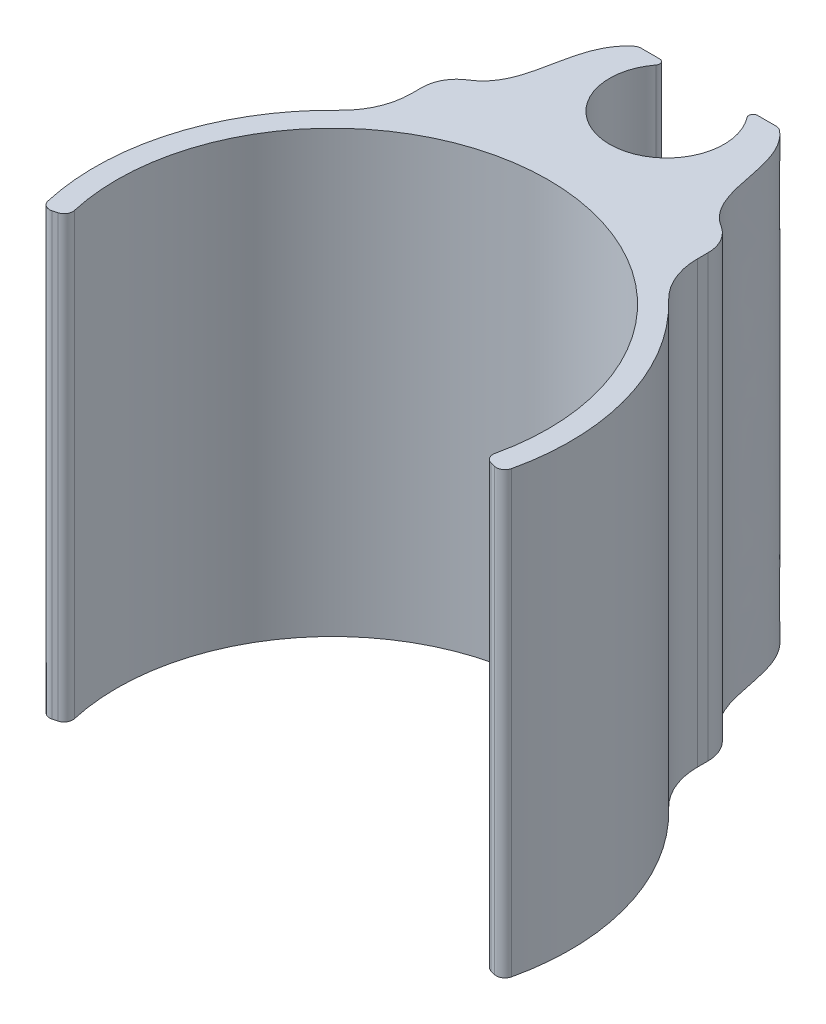
ISO-10303-21;
HEADER;
FILE_DESCRIPTION(('STEP AP214'),'2;1');
FILE_NAME('part.step','',(''),(''),'','','');
FILE_SCHEMA(('AUTOMOTIVE_DESIGN { 1 0 10303 214 1 1 1 1 }'));
ENDSEC;
DATA;
#1=APPLICATION_CONTEXT('core data for automotive mechanical design processes');
#2=APPLICATION_PROTOCOL_DEFINITION('international standard','automotive_design',2000,#1);
#3=PRODUCT_CONTEXT('',#1,'mechanical');
#4=PRODUCT('Part','Part','',(#3));
#5=PRODUCT_RELATED_PRODUCT_CATEGORY('part','',(#4));
#6=PRODUCT_DEFINITION_FORMATION('','',#4);
#7=PRODUCT_DEFINITION_CONTEXT('part definition',#1,'design');
#8=PRODUCT_DEFINITION('design','',#6,#7);
#9=PRODUCT_DEFINITION_SHAPE('','',#8);
#10=(LENGTH_UNIT() NAMED_UNIT(*) SI_UNIT(.MILLI.,.METRE.));
#11=(NAMED_UNIT(*) PLANE_ANGLE_UNIT() SI_UNIT($,.RADIAN.));
#12=(NAMED_UNIT(*) SI_UNIT($,.STERADIAN.) SOLID_ANGLE_UNIT());
#13=UNCERTAINTY_MEASURE_WITH_UNIT(LENGTH_MEASURE(1.E-05),#10,'distance_accuracy_value','');
#14=(GEOMETRIC_REPRESENTATION_CONTEXT(3) GLOBAL_UNCERTAINTY_ASSIGNED_CONTEXT((#13)) GLOBAL_UNIT_ASSIGNED_CONTEXT((#10,
#11,#12)) REPRESENTATION_CONTEXT('',''));
#15=CARTESIAN_POINT('',(0.,0.,0.));
#16=DIRECTION('',(0.,0.,1.));
#17=DIRECTION('',(1.,0.,0.));
#18=AXIS2_PLACEMENT_3D('',#15,#16,#17);
#19=CARTESIAN_POINT('',(-8.255,25.4,-21.701));
#20=DIRECTION('',(0.,0.,1.));
#21=DIRECTION('',(1.,0.,0.));
#22=AXIS2_PLACEMENT_3D('',#19,#20,#21);
#23=PLANE('',#22);
#24=DIRECTION('',(-1.,0.,0.));
#25=VECTOR('',#24,1.);
#26=CARTESIAN_POINT('',(-8.255,0.,-21.701));
#27=LINE('',#26,#25);
#28=CARTESIAN_POINT('',(3.88793647066564,0.,-21.701));
#29=VERTEX_POINT('',#28);
#30=CARTESIAN_POINT('',(2.82570358939642,0.,-21.701));
#31=VERTEX_POINT('',#30);
#32=EDGE_CURVE('E205',#29,#31,#27,.T.);
#33=ORIENTED_EDGE('',*,*,#32,.T.);
#34=DIRECTION('',(0.,1.,0.));
#35=VECTOR('',#34,1.);
#36=CARTESIAN_POINT('',(2.82570358939642,25.4,-21.701));
#37=LINE('',#36,#35);
#38=CARTESIAN_POINT('',(2.82570358939642,25.4,-21.701));
#39=VERTEX_POINT('',#38);
#40=EDGE_CURVE('E242',#31,#39,#37,.T.);
#41=ORIENTED_EDGE('',*,*,#40,.T.);
#42=DIRECTION('',(-1.,0.,0.));
#43=VECTOR('',#42,1.);
#44=CARTESIAN_POINT('',(-8.255,25.4,-21.701));
#45=LINE('',#44,#43);
#46=CARTESIAN_POINT('',(3.88793647066564,25.4,-21.701));
#47=VERTEX_POINT('',#46);
#48=EDGE_CURVE('E372',#47,#39,#45,.T.);
#49=ORIENTED_EDGE('',*,*,#48,.F.);
#50=DIRECTION('',(0.,1.,0.));
#51=VECTOR('',#50,1.);
#52=CARTESIAN_POINT('',(3.88793647066564,25.4,-21.701));
#53=LINE('',#52,#51);
#54=EDGE_CURVE('E240',#47,#29,#53,.F.);
#55=ORIENTED_EDGE('',*,*,#54,.T.);
#56=EDGE_LOOP('',(#33,#41,#49,#55));
#57=FACE_BOUND('',#56,.T.);
#58=ADVANCED_FACE('F33',(#57),#23,.F.);
#59=CARTESIAN_POINT('',(0.,25.4,0.));
#60=DIRECTION('',(0.,-1.,0.));
#61=DIRECTION('',(0.,0.,-1.));
#62=AXIS2_PLACEMENT_3D('',#59,#60,#61);
#63=CYLINDRICAL_SURFACE('',#62,13.716);
#64=CARTESIAN_POINT('',(0.,25.4,0.));
#65=DIRECTION('',(0.,1.,0.));
#66=DIRECTION('',(0.,0.,1.));
#67=AXIS2_PLACEMENT_3D('',#64,#65,#66);
#68=CIRCLE('',#67,13.716);
#69=CARTESIAN_POINT('',(13.3734591112765,25.4,3.04618571315288));
#70=VERTEX_POINT('',#69);
#71=CARTESIAN_POINT('',(9.48800970873786,25.4,-9.90486384393526));
#72=VERTEX_POINT('',#71);
#73=EDGE_CURVE('E352',#70,#72,#68,.T.);
#74=ORIENTED_EDGE('',*,*,#73,.F.);
#75=DIRECTION('',(0.,-1.,0.));
#76=VECTOR('',#75,1.);
#77=CARTESIAN_POINT('',(13.3734591112765,25.4,3.04618571315288));
#78=LINE('',#77,#76);
#79=CARTESIAN_POINT('',(13.3734591112765,0.,3.04618571315288));
#80=VERTEX_POINT('',#79);
#81=EDGE_CURVE('E297',#70,#80,#78,.T.);
#82=ORIENTED_EDGE('',*,*,#81,.T.);
#83=CARTESIAN_POINT('',(0.,0.,0.));
#84=DIRECTION('',(0.,1.,0.));
#85=DIRECTION('',(0.,0.,1.));
#86=AXIS2_PLACEMENT_3D('',#83,#84,#85);
#87=CIRCLE('',#86,13.716);
#88=CARTESIAN_POINT('',(9.48800970873786,0.,-9.90486384393526));
#89=VERTEX_POINT('',#88);
#90=EDGE_CURVE('E363',#80,#89,#87,.T.);
#91=ORIENTED_EDGE('',*,*,#90,.T.);
#92=DIRECTION('',(0.,-1.,0.));
#93=VECTOR('',#92,1.);
#94=CARTESIAN_POINT('',(9.48800970873787,25.4,-9.90486384393526));
#95=LINE('',#94,#93);
#96=EDGE_CURVE('E285',#89,#72,#95,.F.);
#97=ORIENTED_EDGE('',*,*,#96,.T.);
#98=EDGE_LOOP('',(#74,#82,#91,#97));
#99=FACE_BOUND('',#98,.T.);
#100=ADVANCED_FACE('F436',(#99),#63,.T.);
#101=CARTESIAN_POINT('',(8.255,25.4,-21.701));
#102=DIRECTION('',(-1.,0.,0.));
#103=DIRECTION('',(0.,0.,1.));
#104=AXIS2_PLACEMENT_3D('',#101,#102,#103);
#105=PLANE('',#104);
#106=DIRECTION('',(0.,0.,-1.));
#107=VECTOR('',#106,1.);
#108=CARTESIAN_POINT('',(8.255,25.4,-14.716));
#109=LINE('',#108,#107);
#110=CARTESIAN_POINT('',(8.255,25.4,-12.7934213953891));
#111=VERTEX_POINT('',#110);
#112=CARTESIAN_POINT('',(8.255,25.4,-13.411460138268));
#113=VERTEX_POINT('',#112);
#114=EDGE_CURVE('E376',#111,#113,#109,.T.);
#115=ORIENTED_EDGE('',*,*,#114,.F.);
#116=DIRECTION('',(0.,1.,0.));
#117=VECTOR('',#116,1.);
#118=CARTESIAN_POINT('',(8.255,0.,-12.7934213953891));
#119=LINE('',#118,#117);
#120=CARTESIAN_POINT('',(8.255,0.,-12.7934213953891));
#121=VERTEX_POINT('',#120);
#122=EDGE_CURVE('E282',#111,#121,#119,.F.);
#123=ORIENTED_EDGE('',*,*,#122,.T.);
#124=DIRECTION('',(0.,0.,-1.));
#125=VECTOR('',#124,1.);
#126=CARTESIAN_POINT('',(8.255,0.,-21.701));
#127=LINE('',#126,#125);
#128=CARTESIAN_POINT('',(8.255,0.,-13.411460138268));
#129=VERTEX_POINT('',#128);
#130=EDGE_CURVE('E206',#121,#129,#127,.T.);
#131=ORIENTED_EDGE('',*,*,#130,.T.);
#132=DIRECTION('',(0.,1.,0.));
#133=VECTOR('',#132,1.);
#134=CARTESIAN_POINT('',(8.255,25.4,-13.411460138268));
#135=LINE('',#134,#133);
#136=EDGE_CURVE('E272',#129,#113,#135,.T.);
#137=ORIENTED_EDGE('',*,*,#136,.T.);
#138=EDGE_LOOP('',(#115,#123,#131,#137));
#139=FACE_BOUND('',#138,.T.);
#140=ADVANCED_FACE('F433',(#139),#105,.F.);
#141=CARTESIAN_POINT('',(-2.82570358939642,25.4,-21.701));
#142=VERTEX_POINT('',#141);
#143=CARTESIAN_POINT('',(-3.88793647066565,25.4,-21.701));
#144=VERTEX_POINT('',#143);
#145=EDGE_CURVE('E375',#142,#144,#45,.T.);
#146=ORIENTED_EDGE('',*,*,#145,.F.);
#147=DIRECTION('',(0.,1.,0.));
#148=VECTOR('',#147,1.);
#149=CARTESIAN_POINT('',(-2.82570358939642,25.4,-21.701));
#150=LINE('',#149,#148);
#151=CARTESIAN_POINT('',(-2.82570358939642,0.,-21.701));
#152=VERTEX_POINT('',#151);
#153=EDGE_CURVE('E203',#142,#152,#150,.F.);
#154=ORIENTED_EDGE('',*,*,#153,.T.);
#155=CARTESIAN_POINT('',(-3.88793647066565,0.,-21.701));
#156=VERTEX_POINT('',#155);
#157=EDGE_CURVE('E196',#152,#156,#27,.T.);
#158=ORIENTED_EDGE('',*,*,#157,.T.);
#159=DIRECTION('',(0.,1.,0.));
#160=VECTOR('',#159,1.);
#161=CARTESIAN_POINT('',(-3.88793647066565,25.4,-21.701));
#162=LINE('',#161,#160);
#163=EDGE_CURVE('E201',#156,#144,#162,.T.);
#164=ORIENTED_EDGE('',*,*,#163,.T.);
#165=EDGE_LOOP('',(#146,#154,#158,#164));
#166=FACE_BOUND('',#165,.T.);
#167=ADVANCED_FACE('F199',(#166),#23,.F.);
#168=CARTESIAN_POINT('',(-8.255,25.4,-14.716));
#169=DIRECTION('',(1.,0.,0.));
#170=DIRECTION('',(0.,0.,-1.));
#171=AXIS2_PLACEMENT_3D('',#168,#169,#170);
#172=PLANE('',#171);
#173=DIRECTION('',(0.,0.,1.));
#174=VECTOR('',#173,1.);
#175=CARTESIAN_POINT('',(-8.255,0.,-14.716));
#176=LINE('',#175,#174);
#177=CARTESIAN_POINT('',(-8.255,0.,-13.411460138268));
#178=VERTEX_POINT('',#177);
#179=CARTESIAN_POINT('',(-8.255,0.,-12.7934213953891));
#180=VERTEX_POINT('',#179);
#181=EDGE_CURVE('E358',#178,#180,#176,.T.);
#182=ORIENTED_EDGE('',*,*,#181,.T.);
#183=DIRECTION('',(0.,1.,0.));
#184=VECTOR('',#183,1.);
#185=CARTESIAN_POINT('',(-8.255,25.4,-12.7934213953891));
#186=LINE('',#185,#184);
#187=CARTESIAN_POINT('',(-8.255,25.4,-12.7934213953891));
#188=VERTEX_POINT('',#187);
#189=EDGE_CURVE('E280',#180,#188,#186,.T.);
#190=ORIENTED_EDGE('',*,*,#189,.T.);
#191=DIRECTION('',(0.,0.,1.));
#192=VECTOR('',#191,1.);
#193=CARTESIAN_POINT('',(-8.255,25.4,-14.716));
#194=LINE('',#193,#192);
#195=CARTESIAN_POINT('',(-8.255,25.4,-13.411460138268));
#196=VERTEX_POINT('',#195);
#197=EDGE_CURVE('E369',#196,#188,#194,.T.);
#198=ORIENTED_EDGE('',*,*,#197,.F.);
#199=DIRECTION('',(0.,1.,0.));
#200=VECTOR('',#199,1.);
#201=CARTESIAN_POINT('',(-8.255,25.4,-13.411460138268));
#202=LINE('',#201,#200);
#203=EDGE_CURVE('E265',#196,#178,#202,.F.);
#204=ORIENTED_EDGE('',*,*,#203,.T.);
#205=EDGE_LOOP('',(#182,#190,#198,#204));
#206=FACE_BOUND('',#205,.T.);
#207=ADVANCED_FACE('F426',(#206),#172,.F.);
#208=CARTESIAN_POINT('',(0.,25.4,0.));
#209=DIRECTION('',(0.,-1.,0.));
#210=DIRECTION('',(0.,0.,-1.));
#211=AXIS2_PLACEMENT_3D('',#208,#209,#210);
#212=CYLINDRICAL_SURFACE('',#211,13.716);
#213=CARTESIAN_POINT('',(0.,0.,0.));
#214=DIRECTION('',(0.,1.,0.));
#215=DIRECTION('',(0.,0.,1.));
#216=AXIS2_PLACEMENT_3D('',#213,#214,#215);
#217=CIRCLE('',#216,13.716);
#218=CARTESIAN_POINT('',(-9.48800970873787,0.,-9.90486384393526));
#219=VERTEX_POINT('',#218);
#220=CARTESIAN_POINT('',(-13.3734591112765,0.,3.04618571315288));
#221=VERTEX_POINT('',#220);
#222=EDGE_CURVE('E353',#219,#221,#217,.T.);
#223=ORIENTED_EDGE('',*,*,#222,.T.);
#224=DIRECTION('',(0.,-1.,0.));
#225=VECTOR('',#224,1.);
#226=CARTESIAN_POINT('',(-13.3734591112765,25.4,3.04618571315288));
#227=LINE('',#226,#225);
#228=CARTESIAN_POINT('',(-13.3734591112765,25.4,3.04618571315288));
#229=VERTEX_POINT('',#228);
#230=EDGE_CURVE('E11',#221,#229,#227,.F.);
#231=ORIENTED_EDGE('',*,*,#230,.T.);
#232=CARTESIAN_POINT('',(0.,25.4,0.));
#233=DIRECTION('',(0.,1.,0.));
#234=DIRECTION('',(0.,0.,1.));
#235=AXIS2_PLACEMENT_3D('',#232,#233,#234);
#236=CIRCLE('',#235,13.716);
#237=CARTESIAN_POINT('',(-9.48800970873787,25.4,-9.90486384393526));
#238=VERTEX_POINT('',#237);
#239=EDGE_CURVE('E341',#238,#229,#236,.T.);
#240=ORIENTED_EDGE('',*,*,#239,.F.);
#241=DIRECTION('',(0.,-1.,0.));
#242=VECTOR('',#241,1.);
#243=CARTESIAN_POINT('',(-9.48800970873787,25.4,-9.90486384393526));
#244=LINE('',#243,#242);
#245=EDGE_CURVE('E277',#238,#219,#244,.T.);
#246=ORIENTED_EDGE('',*,*,#245,.T.);
#247=EDGE_LOOP('',(#223,#231,#240,#246));
#248=FACE_BOUND('',#247,.T.);
#249=ADVANCED_FACE('F423',(#248),#212,.T.);
#250=CARTESIAN_POINT('',(-13.2486386333809,25.4,3.54996202262618));
#251=DIRECTION('',(-0.258819045102521,0.,-0.965925826289068));
#252=DIRECTION('',(-0.965925826289068,0.,0.258819045102521));
#253=AXIS2_PLACEMENT_3D('',#250,#251,#252);
#254=PLANE('',#253);
#255=DIRECTION('',(0.965925826289068,0.,-0.258819045102521));
#256=VECTOR('',#255,1.);
#257=CARTESIAN_POINT('',(-13.2486386333809,0.,3.54996202262618));
#258=LINE('',#257,#256);
#259=CARTESIAN_POINT('',(-12.7565364977629,0.,3.41810365279373));
#260=VERTEX_POINT('',#259);
#261=CARTESIAN_POINT('',(-12.4955457774318,0.,3.34817140004899));
#262=VERTEX_POINT('',#261);
#263=EDGE_CURVE('E334',#260,#262,#258,.T.);
#264=ORIENTED_EDGE('',*,*,#263,.T.);
#265=DIRECTION('',(0.,-1.,0.));
#266=VECTOR('',#265,1.);
#267=CARTESIAN_POINT('',(-12.4955457774318,25.4,3.34817140004899));
#268=LINE('',#267,#266);
#269=CARTESIAN_POINT('',(-12.4955457774318,25.4,3.34817140004899));
#270=VERTEX_POINT('',#269);
#271=EDGE_CURVE('E41',#262,#270,#268,.F.);
#272=ORIENTED_EDGE('',*,*,#271,.T.);
#273=DIRECTION('',(0.965925826289068,0.,-0.258819045102521));
#274=VECTOR('',#273,1.);
#275=CARTESIAN_POINT('',(-13.2486386333809,25.4,3.54996202262618));
#276=LINE('',#275,#274);
#277=CARTESIAN_POINT('',(-12.7565364977629,25.4,3.41810365279373));
#278=VERTEX_POINT('',#277);
#279=EDGE_CURVE('E331',#278,#270,#276,.T.);
#280=ORIENTED_EDGE('',*,*,#279,.F.);
#281=DIRECTION('',(0.,-1.,0.));
#282=VECTOR('',#281,1.);
#283=CARTESIAN_POINT('',(-12.7565364977629,25.4,3.41810365279373));
#284=LINE('',#283,#282);
#285=EDGE_CURVE('E324',#278,#260,#284,.T.);
#286=ORIENTED_EDGE('',*,*,#285,.T.);
#287=EDGE_LOOP('',(#264,#272,#280,#286));
#288=FACE_BOUND('',#287,.T.);
#289=ADVANCED_FACE('F330',(#288),#254,.F.);
#290=CARTESIAN_POINT('',(0.,25.4,0.));
#291=DIRECTION('',(0.,-1.,0.));
#292=DIRECTION('',(0.,0.,-1.));
#293=AXIS2_PLACEMENT_3D('',#290,#291,#292);
#294=CYLINDRICAL_SURFACE('',#293,12.446);
#295=CARTESIAN_POINT('',(0.,0.,0.));
#296=DIRECTION('',(0.,-1.,0.));
#297=DIRECTION('',(0.,0.,-1.));
#298=AXIS2_PLACEMENT_3D('',#295,#296,#297);
#299=CIRCLE('',#298,12.446);
#300=CARTESIAN_POINT('',(-12.13735467817,0.,2.75454849590706));
#301=VERTEX_POINT('',#300);
#302=CARTESIAN_POINT('',(12.13735467817,0.,2.75454849590706));
#303=VERTEX_POINT('',#302);
#304=EDGE_CURVE('E347',#301,#303,#299,.T.);
#305=ORIENTED_EDGE('',*,*,#304,.T.);
#306=DIRECTION('',(0.,-1.,0.));
#307=VECTOR('',#306,1.);
#308=CARTESIAN_POINT('',(12.13735467817,25.4,2.75454849590706));
#309=LINE('',#308,#307);
#310=CARTESIAN_POINT('',(12.13735467817,25.4,2.75454849590706));
#311=VERTEX_POINT('',#310);
#312=EDGE_CURVE('E48',#303,#311,#309,.F.);
#313=ORIENTED_EDGE('',*,*,#312,.T.);
#314=CARTESIAN_POINT('',(0.,25.4,0.));
#315=DIRECTION('',(0.,-1.,0.));
#316=DIRECTION('',(0.,0.,-1.));
#317=AXIS2_PLACEMENT_3D('',#314,#315,#316);
#318=CIRCLE('',#317,12.446);
#319=CARTESIAN_POINT('',(-12.13735467817,25.4,2.75454849590706));
#320=VERTEX_POINT('',#319);
#321=EDGE_CURVE('E340',#320,#311,#318,.T.);
#322=ORIENTED_EDGE('',*,*,#321,.F.);
#323=DIRECTION('',(0.,-1.,0.));
#324=VECTOR('',#323,1.);
#325=CARTESIAN_POINT('',(-12.13735467817,25.4,2.75454849590706));
#326=LINE('',#325,#324);
#327=EDGE_CURVE('E320',#320,#301,#326,.T.);
#328=ORIENTED_EDGE('',*,*,#327,.T.);
#329=EDGE_LOOP('',(#305,#313,#322,#328));
#330=FACE_BOUND('',#329,.T.);
#331=ADVANCED_FACE('F346',(#330),#294,.F.);
#332=CARTESIAN_POINT('',(12.0219128339937,25.4,3.22126183534598));
#333=DIRECTION('',(0.258819045102521,0.,-0.965925826289068));
#334=DIRECTION('',(-0.965925826289068,0.,-0.258819045102521));
#335=AXIS2_PLACEMENT_3D('',#332,#333,#334);
#336=PLANE('',#335);
#337=DIRECTION('',(0.965925826289068,0.,0.258819045102521));
#338=VECTOR('',#337,1.);
#339=CARTESIAN_POINT('',(12.0219128339937,0.,3.22126183534598));
#340=LINE('',#339,#338);
#341=CARTESIAN_POINT('',(12.4955457774318,0.,3.34817140004899));
#342=VERTEX_POINT('',#341);
#343=CARTESIAN_POINT('',(12.7565364977629,0.,3.41810365279373));
#344=VERTEX_POINT('',#343);
#345=EDGE_CURVE('E349',#342,#344,#340,.T.);
#346=ORIENTED_EDGE('',*,*,#345,.T.);
#347=DIRECTION('',(0.,-1.,0.));
#348=VECTOR('',#347,1.);
#349=CARTESIAN_POINT('',(12.7565364977629,25.4,3.41810365279373));
#350=LINE('',#349,#348);
#351=CARTESIAN_POINT('',(12.7565364977629,25.4,3.41810365279373));
#352=VERTEX_POINT('',#351);
#353=EDGE_CURVE('E311',#344,#352,#350,.F.);
#354=ORIENTED_EDGE('',*,*,#353,.T.);
#355=DIRECTION('',(0.965925826289068,0.,0.258819045102521));
#356=VECTOR('',#355,1.);
#357=CARTESIAN_POINT('',(12.0219128339937,25.4,3.22126183534598));
#358=LINE('',#357,#356);
#359=CARTESIAN_POINT('',(12.4955457774318,25.4,3.34817140004899));
#360=VERTEX_POINT('',#359);
#361=EDGE_CURVE('E229',#360,#352,#358,.T.);
#362=ORIENTED_EDGE('',*,*,#361,.F.);
#363=DIRECTION('',(0.,-1.,0.));
#364=VECTOR('',#363,1.);
#365=CARTESIAN_POINT('',(12.4955457774318,25.4,3.34817140004899));
#366=LINE('',#365,#364);
#367=EDGE_CURVE('E308',#360,#342,#366,.T.);
#368=ORIENTED_EDGE('',*,*,#367,.T.);
#369=EDGE_LOOP('',(#346,#354,#362,#368));
#370=FACE_BOUND('',#369,.T.);
#371=ADVANCED_FACE('F413',(#370),#336,.F.);
#372=CARTESIAN_POINT('',(0.,25.4,0.));
#373=DIRECTION('',(0.,1.,0.));
#374=DIRECTION('',(0.,0.,1.));
#375=AXIS2_PLACEMENT_3D('',#372,#373,#374);
#376=PLANE('',#375);
#377=ORIENTED_EDGE('',*,*,#361,.T.);
#378=CARTESIAN_POINT('',(12.8859460203142,25.4,2.9351407396492));
#379=DIRECTION('',(0.,1.,0.));
#380=DIRECTION('',(0.,0.,1.));
#381=AXIS2_PLACEMENT_3D('',#378,#379,#380);
#382=CIRCLE('',#381,0.5);
#383=EDGE_CURVE('E318',#352,#70,#382,.T.);
#384=ORIENTED_EDGE('',*,*,#383,.T.);
#385=ORIENTED_EDGE('',*,*,#73,.T.);
#386=CARTESIAN_POINT('',(12.255,25.4,-12.7934213953891));
#387=DIRECTION('',(0.,1.,0.));
#388=DIRECTION('',(0.,0.,1.));
#389=AXIS2_PLACEMENT_3D('',#386,#387,#388);
#390=CIRCLE('',#389,4.);
#391=EDGE_CURVE('E295',#72,#111,#390,.F.);
#392=ORIENTED_EDGE('',*,*,#391,.T.);
#393=ORIENTED_EDGE('',*,*,#114,.T.);
#394=CARTESIAN_POINT('',(6.25500000000037,25.4,-13.411460138268));
#395=DIRECTION('',(0.,1.,0.));
#396=DIRECTION('',(0.,0.,1.));
#397=AXIS2_PLACEMENT_3D('',#394,#395,#396);
#398=CIRCLE('',#397,2.);
#399=CARTESIAN_POINT('',(7.31053446654785,25.4,-15.1102382255795));
#400=VERTEX_POINT('',#399);
#401=EDGE_CURVE('E261',#113,#400,#398,.T.);
#402=ORIENTED_EDGE('',*,*,#401,.T.);
#403=CARTESIAN_POINT('',(4.063143766,25.4,-21.701));
#404=CARTESIAN_POINT('',(6.51924555423488,25.4,-19.8931172669846));
#405=CARTESIAN_POINT('',(4.73933878267677,25.4,-15.6361895955112));
#406=CARTESIAN_POINT('',(8.255,25.4,-14.716));
#407=B_SPLINE_CURVE_WITH_KNOTS('',3,(#403,#404,#405,#406),.UNSPECIFIED.,.F.,.F.,(4,4),(0.,1.),.UNSPECIFIED.);
#408=CARTESIAN_POINT('',(4.21405813591732,25.4,-21.5824979582148));
#409=VERTEX_POINT('',#408);
#410=EDGE_CURVE('E517',#409,#400,#407,.T.);
#411=ORIENTED_EDGE('',*,*,#410,.F.);
#412=CARTESIAN_POINT('',(3.88793647066564,25.4,-21.193));
#413=DIRECTION('',(0.,1.,0.));
#414=DIRECTION('',(0.,0.,1.));
#415=AXIS2_PLACEMENT_3D('',#412,#413,#414);
#416=CIRCLE('',#415,0.508);
#417=EDGE_CURVE('E224',#409,#47,#416,.T.);
#418=ORIENTED_EDGE('',*,*,#417,.T.);
#419=ORIENTED_EDGE('',*,*,#48,.T.);
#420=CARTESIAN_POINT('',(2.82570358939642,25.4,-21.447));
#421=DIRECTION('',(0.,1.,0.));
#422=DIRECTION('',(0.,0.,1.));
#423=AXIS2_PLACEMENT_3D('',#420,#421,#422);
#424=CIRCLE('',#423,0.254);
#425=CARTESIAN_POINT('',(2.62386761872525,25.4,-21.2927980514286));
#426=VERTEX_POINT('',#425);
#427=EDGE_CURVE('E247',#39,#426,#424,.T.);
#428=ORIENTED_EDGE('',*,*,#427,.T.);
#429=CARTESIAN_POINT('',(0.,25.4,-19.28817272));
#430=DIRECTION('',(0.,1.,0.));
#431=DIRECTION('',(0.,0.,1.));
#432=AXIS2_PLACEMENT_3D('',#429,#430,#431);
#433=CIRCLE('',#432,3.302);
#434=CARTESIAN_POINT('',(-2.62386761872525,25.4,-21.2927980514286));
#435=VERTEX_POINT('',#434);
#436=EDGE_CURVE('E365',#435,#426,#433,.T.);
#437=ORIENTED_EDGE('',*,*,#436,.F.);
#438=CARTESIAN_POINT('',(-2.82570358939642,25.4,-21.447));
#439=DIRECTION('',(0.,1.,0.));
#440=DIRECTION('',(0.,0.,1.));
#441=AXIS2_PLACEMENT_3D('',#438,#439,#440);
#442=CIRCLE('',#441,0.254);
#443=EDGE_CURVE('E245',#435,#142,#442,.T.);
#444=ORIENTED_EDGE('',*,*,#443,.T.);
#445=ORIENTED_EDGE('',*,*,#145,.T.);
#446=CARTESIAN_POINT('',(-3.88793647066565,25.4,-21.193));
#447=DIRECTION('',(0.,1.,0.));
#448=DIRECTION('',(0.,0.,1.));
#449=AXIS2_PLACEMENT_3D('',#446,#447,#448);
#450=CIRCLE('',#449,0.508);
#451=CARTESIAN_POINT('',(-4.21405813591731,25.4,-21.5824979582148));
#452=VERTEX_POINT('',#451);
#453=EDGE_CURVE('E223',#144,#452,#450,.T.);
#454=ORIENTED_EDGE('',*,*,#453,.T.);
#455=CARTESIAN_POINT('',(-8.255,25.4,-14.716));
#456=CARTESIAN_POINT('',(-4.73933878267677,25.4,-15.6361895955112));
#457=CARTESIAN_POINT('',(-6.51924555423487,25.4,-19.8931172669846));
#458=CARTESIAN_POINT('',(-4.063143766,25.4,-21.701));
#459=B_SPLINE_CURVE_WITH_KNOTS('',3,(#455,#456,#457,#458),.UNSPECIFIED.,.F.,.F.,(4,4),(0.,1.),.UNSPECIFIED.);
#460=CARTESIAN_POINT('',(-7.31053446654778,25.4,-15.1102382255796));
#461=VERTEX_POINT('',#460);
#462=EDGE_CURVE('E381',#461,#452,#459,.T.);
#463=ORIENTED_EDGE('',*,*,#462,.F.);
#464=CARTESIAN_POINT('',(-6.25500000000019,25.4,-13.411460138268));
#465=DIRECTION('',(0.,1.,0.));
#466=DIRECTION('',(0.,0.,1.));
#467=AXIS2_PLACEMENT_3D('',#464,#465,#466);
#468=CIRCLE('',#467,2.);
#469=EDGE_CURVE('E263',#461,#196,#468,.T.);
#470=ORIENTED_EDGE('',*,*,#469,.T.);
#471=ORIENTED_EDGE('',*,*,#197,.T.);
#472=CARTESIAN_POINT('',(-12.255,25.4,-12.7934213953891));
#473=DIRECTION('',(0.,1.,0.));
#474=DIRECTION('',(0.,0.,1.));
#475=AXIS2_PLACEMENT_3D('',#472,#473,#474);
#476=CIRCLE('',#475,4.);
#477=EDGE_CURVE('E290',#188,#238,#476,.F.);
#478=ORIENTED_EDGE('',*,*,#477,.T.);
#479=ORIENTED_EDGE('',*,*,#239,.T.);
#480=CARTESIAN_POINT('',(-12.8859460203142,25.4,2.9351407396492));
#481=DIRECTION('',(0.,1.,0.));
#482=DIRECTION('',(0.,0.,1.));
#483=AXIS2_PLACEMENT_3D('',#480,#481,#482);
#484=CIRCLE('',#483,0.5);
#485=EDGE_CURVE('E313',#229,#278,#484,.T.);
#486=ORIENTED_EDGE('',*,*,#485,.T.);
#487=ORIENTED_EDGE('',*,*,#279,.T.);
#488=CARTESIAN_POINT('',(-12.6249552999831,25.4,2.86520848690445));
#489=DIRECTION('',(0.,1.,0.));
#490=DIRECTION('',(0.,0.,1.));
#491=AXIS2_PLACEMENT_3D('',#488,#489,#490);
#492=CIRCLE('',#491,0.5);
#493=EDGE_CURVE('E55',#270,#320,#492,.T.);
#494=ORIENTED_EDGE('',*,*,#493,.T.);
#495=ORIENTED_EDGE('',*,*,#321,.T.);
#496=CARTESIAN_POINT('',(12.6249552999831,25.4,2.86520848690445));
#497=DIRECTION('',(0.,1.,0.));
#498=DIRECTION('',(0.,0.,1.));
#499=AXIS2_PLACEMENT_3D('',#496,#497,#498);
#500=CIRCLE('',#499,0.5);
#501=EDGE_CURVE('E316',#311,#360,#500,.T.);
#502=ORIENTED_EDGE('',*,*,#501,.T.);
#503=EDGE_LOOP('',(#377,#384,#385,#392,#393,#402,#411,#418,#419,#428,#437,#444,#445,#454,#463,
#470,#471,#478,#479,#486,#487,#494,#495,#502));
#504=FACE_BOUND('',#503,.T.);
#505=ADVANCED_FACE('F337',(#504),#376,.T.);
#506=CARTESIAN_POINT('',(0.,0.,0.));
#507=DIRECTION('',(0.,1.,0.));
#508=DIRECTION('',(0.,0.,1.));
#509=AXIS2_PLACEMENT_3D('',#506,#507,#508);
#510=PLANE('',#509);
#511=ORIENTED_EDGE('',*,*,#90,.F.);
#512=CARTESIAN_POINT('',(12.8859460203142,0.,2.9351407396492));
#513=DIRECTION('',(0.,1.,0.));
#514=DIRECTION('',(0.,0.,1.));
#515=AXIS2_PLACEMENT_3D('',#512,#513,#514);
#516=CIRCLE('',#515,0.5);
#517=EDGE_CURVE('E306',#80,#344,#516,.F.);
#518=ORIENTED_EDGE('',*,*,#517,.T.);
#519=ORIENTED_EDGE('',*,*,#345,.F.);
#520=CARTESIAN_POINT('',(12.6249552999831,0.,2.86520848690445));
#521=DIRECTION('',(0.,1.,0.));
#522=DIRECTION('',(0.,0.,1.));
#523=AXIS2_PLACEMENT_3D('',#520,#521,#522);
#524=CIRCLE('',#523,0.5);
#525=EDGE_CURVE('E304',#342,#303,#524,.F.);
#526=ORIENTED_EDGE('',*,*,#525,.T.);
#527=ORIENTED_EDGE('',*,*,#304,.F.);
#528=CARTESIAN_POINT('',(-12.6249552999831,0.,2.86520848690445));
#529=DIRECTION('',(0.,1.,0.));
#530=DIRECTION('',(0.,0.,1.));
#531=AXIS2_PLACEMENT_3D('',#528,#529,#530);
#532=CIRCLE('',#531,0.5);
#533=EDGE_CURVE('E302',#301,#262,#532,.F.);
#534=ORIENTED_EDGE('',*,*,#533,.T.);
#535=ORIENTED_EDGE('',*,*,#263,.F.);
#536=CARTESIAN_POINT('',(-12.8859460203142,0.,2.9351407396492));
#537=DIRECTION('',(0.,1.,0.));
#538=DIRECTION('',(0.,0.,1.));
#539=AXIS2_PLACEMENT_3D('',#536,#537,#538);
#540=CIRCLE('',#539,0.5);
#541=EDGE_CURVE('E300',#260,#221,#540,.F.);
#542=ORIENTED_EDGE('',*,*,#541,.T.);
#543=ORIENTED_EDGE('',*,*,#222,.F.);
#544=CARTESIAN_POINT('',(-12.255,0.,-12.7934213953891));
#545=DIRECTION('',(0.,1.,0.));
#546=DIRECTION('',(0.,0.,1.));
#547=AXIS2_PLACEMENT_3D('',#544,#545,#546);
#548=CIRCLE('',#547,4.);
#549=EDGE_CURVE('E288',#219,#180,#548,.T.);
#550=ORIENTED_EDGE('',*,*,#549,.T.);
#551=ORIENTED_EDGE('',*,*,#181,.F.);
#552=CARTESIAN_POINT('',(-6.25500000000019,0.,-13.411460138268));
#553=DIRECTION('',(0.,1.,0.));
#554=DIRECTION('',(0.,0.,1.));
#555=AXIS2_PLACEMENT_3D('',#552,#553,#554);
#556=CIRCLE('',#555,2.);
#557=CARTESIAN_POINT('',(-7.31053446654778,0.,-15.1102382255796));
#558=VERTEX_POINT('',#557);
#559=EDGE_CURVE('E270',#178,#558,#556,.F.);
#560=ORIENTED_EDGE('',*,*,#559,.T.);
#561=CARTESIAN_POINT('',(-8.255,0.,-14.716));
#562=CARTESIAN_POINT('',(-4.73933878267677,0.,-15.6361895955112));
#563=CARTESIAN_POINT('',(-6.51924555423487,0.,-19.8931172669846));
#564=CARTESIAN_POINT('',(-4.063143766,0.,-21.701));
#565=B_SPLINE_CURVE_WITH_KNOTS('',3,(#561,#562,#563,#564),.UNSPECIFIED.,.F.,.F.,(4,4),(0.,1.),.UNSPECIFIED.);
#566=CARTESIAN_POINT('',(-4.21405813591731,0.,-21.5824979582148));
#567=VERTEX_POINT('',#566);
#568=EDGE_CURVE('E214',#567,#558,#565,.F.);
#569=ORIENTED_EDGE('',*,*,#568,.F.);
#570=CARTESIAN_POINT('',(-3.88793647066565,0.,-21.193));
#571=DIRECTION('',(0.,1.,0.));
#572=DIRECTION('',(0.,0.,1.));
#573=AXIS2_PLACEMENT_3D('',#570,#571,#572);
#574=CIRCLE('',#573,0.508);
#575=EDGE_CURVE('E210',#567,#156,#574,.F.);
#576=ORIENTED_EDGE('',*,*,#575,.T.);
#577=ORIENTED_EDGE('',*,*,#157,.F.);
#578=CARTESIAN_POINT('',(-2.82570358939642,0.,-21.447));
#579=DIRECTION('',(0.,1.,0.));
#580=DIRECTION('',(0.,0.,1.));
#581=AXIS2_PLACEMENT_3D('',#578,#579,#580);
#582=CIRCLE('',#581,0.254);
#583=CARTESIAN_POINT('',(-2.62386761872525,0.,-21.2927980514286));
#584=VERTEX_POINT('',#583);
#585=EDGE_CURVE('E253',#152,#584,#582,.F.);
#586=ORIENTED_EDGE('',*,*,#585,.T.);
#587=CARTESIAN_POINT('',(0.,0.,-19.28817272));
#588=DIRECTION('',(0.,1.,0.));
#589=DIRECTION('',(0.,0.,1.));
#590=AXIS2_PLACEMENT_3D('',#587,#588,#589);
#591=CIRCLE('',#590,3.302);
#592=CARTESIAN_POINT('',(2.62386761872525,0.,-21.2927980514286));
#593=VERTEX_POINT('',#592);
#594=EDGE_CURVE('E225',#584,#593,#591,.T.);
#595=ORIENTED_EDGE('',*,*,#594,.T.);
#596=CARTESIAN_POINT('',(2.82570358939642,0.,-21.447));
#597=DIRECTION('',(0.,1.,0.));
#598=DIRECTION('',(0.,0.,1.));
#599=AXIS2_PLACEMENT_3D('',#596,#597,#598);
#600=CIRCLE('',#599,0.254);
#601=EDGE_CURVE('E255',#593,#31,#600,.F.);
#602=ORIENTED_EDGE('',*,*,#601,.T.);
#603=ORIENTED_EDGE('',*,*,#32,.F.);
#604=CARTESIAN_POINT('',(3.88793647066564,0.,-21.193));
#605=DIRECTION('',(0.,1.,0.));
#606=DIRECTION('',(0.,0.,1.));
#607=AXIS2_PLACEMENT_3D('',#604,#605,#606);
#608=CIRCLE('',#607,0.508);
#609=CARTESIAN_POINT('',(4.21405813591732,0.,-21.5824979582148));
#610=VERTEX_POINT('',#609);
#611=EDGE_CURVE('E218',#29,#610,#608,.F.);
#612=ORIENTED_EDGE('',*,*,#611,.T.);
#613=CARTESIAN_POINT('',(4.063143766,0.,-21.701));
#614=CARTESIAN_POINT('',(6.51924555423488,0.,-19.8931172669846));
#615=CARTESIAN_POINT('',(4.73933878267677,0.,-15.6361895955112));
#616=CARTESIAN_POINT('',(8.255,0.,-14.716));
#617=B_SPLINE_CURVE_WITH_KNOTS('',3,(#613,#614,#615,#616),.UNSPECIFIED.,.F.,.F.,(4,4),(0.,1.),.UNSPECIFIED.);
#618=CARTESIAN_POINT('',(7.31053446654785,0.,-15.1102382255795));
#619=VERTEX_POINT('',#618);
#620=EDGE_CURVE('E385',#619,#610,#617,.F.);
#621=ORIENTED_EDGE('',*,*,#620,.F.);
#622=CARTESIAN_POINT('',(6.25500000000037,0.,-13.411460138268));
#623=DIRECTION('',(0.,1.,0.));
#624=DIRECTION('',(0.,0.,1.));
#625=AXIS2_PLACEMENT_3D('',#622,#623,#624);
#626=CIRCLE('',#625,2.);
#627=EDGE_CURVE('E267',#619,#129,#626,.F.);
#628=ORIENTED_EDGE('',*,*,#627,.T.);
#629=ORIENTED_EDGE('',*,*,#130,.F.);
#630=CARTESIAN_POINT('',(12.255,0.,-12.7934213953891));
#631=DIRECTION('',(0.,1.,0.));
#632=DIRECTION('',(0.,0.,1.));
#633=AXIS2_PLACEMENT_3D('',#630,#631,#632);
#634=CIRCLE('',#633,4.);
#635=EDGE_CURVE('E292',#121,#89,#634,.T.);
#636=ORIENTED_EDGE('',*,*,#635,.T.);
#637=EDGE_LOOP('',(#511,#518,#519,#526,#527,#534,#535,#542,#543,#550,#551,#560,#569,#576,#577,
#586,#595,#602,#603,#612,#621,#628,#629,#636));
#638=FACE_BOUND('',#637,.T.);
#639=ADVANCED_FACE('F212',(#638),#510,.F.);
#640=CARTESIAN_POINT('',(0.,-9.33946636591192,-19.28817272));
#641=DIRECTION('',(0.,1.,0.));
#642=DIRECTION('',(0.,0.,1.));
#643=AXIS2_PLACEMENT_3D('',#640,#641,#642);
#644=CYLINDRICAL_SURFACE('',#643,3.302);
#645=ORIENTED_EDGE('',*,*,#436,.T.);
#646=DIRECTION('',(0.,1.,0.));
#647=VECTOR('',#646,1.);
#648=CARTESIAN_POINT('',(2.62386761872525,-9.33946636591192,-21.2927980514286));
#649=LINE('',#648,#647);
#650=EDGE_CURVE('E251',#426,#593,#649,.F.);
#651=ORIENTED_EDGE('',*,*,#650,.T.);
#652=ORIENTED_EDGE('',*,*,#594,.F.);
#653=DIRECTION('',(0.,1.,0.));
#654=VECTOR('',#653,1.);
#655=CARTESIAN_POINT('',(-2.62386761872525,-9.33946636591192,-21.2927980514286));
#656=LINE('',#655,#654);
#657=EDGE_CURVE('E249',#584,#435,#656,.T.);
#658=ORIENTED_EDGE('',*,*,#657,.T.);
#659=EDGE_LOOP('',(#645,#651,#652,#658));
#660=FACE_BOUND('',#659,.T.);
#661=ADVANCED_FACE('F405',(#660),#644,.F.);
#662=CARTESIAN_POINT('',(-8.255,-9.33946636591192,-14.716));
#663=CARTESIAN_POINT('',(-4.73933878267677,-9.33946636591192,-15.6361895955112));
#664=CARTESIAN_POINT('',(-6.51924555423487,-9.33946636591192,-19.8931172669846));
#665=CARTESIAN_POINT('',(-4.063143766,-9.33946636591192,-21.701));
#666=B_SPLINE_CURVE_WITH_KNOTS('',3,(#662,#663,#664,#665),.UNSPECIFIED.,.F.,.F.,(4,4),(0.,1.),.UNSPECIFIED.);
#667=DIRECTION('',(0.,1.,0.));
#668=VECTOR('',#667,1.);
#669=SURFACE_OF_LINEAR_EXTRUSION('',#666,#668);
#670=ORIENTED_EDGE('',*,*,#568,.T.);
#671=DIRECTION('',(0.,1.,0.));
#672=VECTOR('',#671,1.);
#673=CARTESIAN_POINT('',(-7.31053446654777,0.,-15.1102382255796));
#674=LINE('',#673,#672);
#675=EDGE_CURVE('E258',#558,#461,#674,.T.);
#676=ORIENTED_EDGE('',*,*,#675,.T.);
#677=ORIENTED_EDGE('',*,*,#462,.T.);
#678=DIRECTION('',(0.,1.,0.));
#679=VECTOR('',#678,1.);
#680=CARTESIAN_POINT('',(-4.21405813592902,25.4,-21.582497958205));
#681=LINE('',#680,#679);
#682=EDGE_CURVE('E234',#452,#567,#681,.F.);
#683=ORIENTED_EDGE('',*,*,#682,.T.);
#684=EDGE_LOOP('',(#670,#676,#677,#683));
#685=FACE_BOUND('',#684,.T.);
#686=ADVANCED_FACE('F400',(#685),#669,.F.);
#687=CARTESIAN_POINT('',(4.063143766,-9.33946636591192,-21.701));
#688=CARTESIAN_POINT('',(6.51924555423488,-9.33946636591192,-19.8931172669846));
#689=CARTESIAN_POINT('',(4.73933878267677,-9.33946636591192,-15.6361895955112));
#690=CARTESIAN_POINT('',(8.255,-9.33946636591192,-14.716));
#691=B_SPLINE_CURVE_WITH_KNOTS('',3,(#687,#688,#689,#690),.UNSPECIFIED.,.F.,.F.,(4,4),(0.,1.),.UNSPECIFIED.);
#692=DIRECTION('',(0.,1.,0.));
#693=VECTOR('',#692,1.);
#694=SURFACE_OF_LINEAR_EXTRUSION('',#691,#693);
#695=ORIENTED_EDGE('',*,*,#410,.T.);
#696=DIRECTION('',(0.,1.,0.));
#697=VECTOR('',#696,1.);
#698=CARTESIAN_POINT('',(7.31053446654785,25.4,-15.1102382255795));
#699=LINE('',#698,#697);
#700=EDGE_CURVE('E275',#400,#619,#699,.F.);
#701=ORIENTED_EDGE('',*,*,#700,.T.);
#702=ORIENTED_EDGE('',*,*,#620,.T.);
#703=DIRECTION('',(0.,1.,0.));
#704=VECTOR('',#703,1.);
#705=CARTESIAN_POINT('',(4.21405813592902,0.,-21.582497958205));
#706=LINE('',#705,#704);
#707=EDGE_CURVE('E217',#610,#409,#706,.T.);
#708=ORIENTED_EDGE('',*,*,#707,.T.);
#709=EDGE_LOOP('',(#695,#701,#702,#708));
#710=FACE_BOUND('',#709,.T.);
#711=ADVANCED_FACE('F404',(#710),#694,.F.);
#712=CARTESIAN_POINT('',(-3.88793647066565,12.7,-21.193));
#713=DIRECTION('',(0.,1.,0.));
#714=DIRECTION('',(0.,0.,1.));
#715=AXIS2_PLACEMENT_3D('',#712,#713,#714);
#716=CYLINDRICAL_SURFACE('',#715,0.508);
#717=ORIENTED_EDGE('',*,*,#575,.F.);
#718=ORIENTED_EDGE('',*,*,#682,.F.);
#719=ORIENTED_EDGE('',*,*,#453,.F.);
#720=ORIENTED_EDGE('',*,*,#163,.F.);
#721=EDGE_LOOP('',(#717,#718,#719,#720));
#722=FACE_BOUND('',#721,.T.);
#723=ADVANCED_FACE('F221',(#722),#716,.T.);
#724=CARTESIAN_POINT('',(3.88793647066564,12.7,-21.193));
#725=DIRECTION('',(0.,1.,0.));
#726=DIRECTION('',(0.,0.,1.));
#727=AXIS2_PLACEMENT_3D('',#724,#725,#726);
#728=CYLINDRICAL_SURFACE('',#727,0.508);
#729=ORIENTED_EDGE('',*,*,#611,.F.);
#730=ORIENTED_EDGE('',*,*,#54,.F.);
#731=ORIENTED_EDGE('',*,*,#417,.F.);
#732=ORIENTED_EDGE('',*,*,#707,.F.);
#733=EDGE_LOOP('',(#729,#730,#731,#732));
#734=FACE_BOUND('',#733,.T.);
#735=ADVANCED_FACE('F443',(#734),#728,.T.);
#736=CARTESIAN_POINT('',(2.82570358939642,-9.33946636591192,-21.447));
#737=DIRECTION('',(0.,1.,0.));
#738=DIRECTION('',(0.,0.,1.));
#739=AXIS2_PLACEMENT_3D('',#736,#737,#738);
#740=CYLINDRICAL_SURFACE('',#739,0.254);
#741=ORIENTED_EDGE('',*,*,#601,.F.);
#742=ORIENTED_EDGE('',*,*,#650,.F.);
#743=ORIENTED_EDGE('',*,*,#427,.F.);
#744=ORIENTED_EDGE('',*,*,#40,.F.);
#745=EDGE_LOOP('',(#741,#742,#743,#744));
#746=FACE_BOUND('',#745,.T.);
#747=ADVANCED_FACE('F446',(#746),#740,.T.);
#748=CARTESIAN_POINT('',(-2.82570358939642,-9.33946636591192,-21.447));
#749=DIRECTION('',(0.,1.,0.));
#750=DIRECTION('',(0.,0.,1.));
#751=AXIS2_PLACEMENT_3D('',#748,#749,#750);
#752=CYLINDRICAL_SURFACE('',#751,0.254);
#753=ORIENTED_EDGE('',*,*,#443,.F.);
#754=ORIENTED_EDGE('',*,*,#657,.F.);
#755=ORIENTED_EDGE('',*,*,#585,.F.);
#756=ORIENTED_EDGE('',*,*,#153,.F.);
#757=EDGE_LOOP('',(#753,#754,#755,#756));
#758=FACE_BOUND('',#757,.T.);
#759=ADVANCED_FACE('F450',(#758),#752,.T.);
#760=CARTESIAN_POINT('',(-6.25500000000019,12.7,-13.411460138268));
#761=DIRECTION('',(0.,1.,0.));
#762=DIRECTION('',(0.,0.,1.));
#763=AXIS2_PLACEMENT_3D('',#760,#761,#762);
#764=CYLINDRICAL_SURFACE('',#763,2.);
#765=ORIENTED_EDGE('',*,*,#559,.F.);
#766=ORIENTED_EDGE('',*,*,#203,.F.);
#767=ORIENTED_EDGE('',*,*,#469,.F.);
#768=ORIENTED_EDGE('',*,*,#675,.F.);
#769=EDGE_LOOP('',(#765,#766,#767,#768));
#770=FACE_BOUND('',#769,.T.);
#771=ADVANCED_FACE('F454',(#770),#764,.T.);
#772=CARTESIAN_POINT('',(6.25500000000037,12.7,-13.411460138268));
#773=DIRECTION('',(0.,1.,0.));
#774=DIRECTION('',(0.,0.,1.));
#775=AXIS2_PLACEMENT_3D('',#772,#773,#774);
#776=CYLINDRICAL_SURFACE('',#775,2.);
#777=ORIENTED_EDGE('',*,*,#627,.F.);
#778=ORIENTED_EDGE('',*,*,#700,.F.);
#779=ORIENTED_EDGE('',*,*,#401,.F.);
#780=ORIENTED_EDGE('',*,*,#136,.F.);
#781=EDGE_LOOP('',(#777,#778,#779,#780));
#782=FACE_BOUND('',#781,.T.);
#783=ADVANCED_FACE('F458',(#782),#776,.T.);
#784=CARTESIAN_POINT('',(-12.255,25.4,-12.7934213953891));
#785=DIRECTION('',(0.,-1.,0.));
#786=DIRECTION('',(0.,0.,-1.));
#787=AXIS2_PLACEMENT_3D('',#784,#785,#786);
#788=CYLINDRICAL_SURFACE('',#787,4.);
#789=ORIENTED_EDGE('',*,*,#477,.F.);
#790=ORIENTED_EDGE('',*,*,#189,.F.);
#791=ORIENTED_EDGE('',*,*,#549,.F.);
#792=ORIENTED_EDGE('',*,*,#245,.F.);
#793=EDGE_LOOP('',(#789,#790,#791,#792));
#794=FACE_BOUND('',#793,.T.);
#795=ADVANCED_FACE('F462',(#794),#788,.F.);
#796=CARTESIAN_POINT('',(12.255,25.4,-12.7934213953891));
#797=DIRECTION('',(0.,-1.,0.));
#798=DIRECTION('',(0.,0.,-1.));
#799=AXIS2_PLACEMENT_3D('',#796,#797,#798);
#800=CYLINDRICAL_SURFACE('',#799,4.);
#801=ORIENTED_EDGE('',*,*,#391,.F.);
#802=ORIENTED_EDGE('',*,*,#96,.F.);
#803=ORIENTED_EDGE('',*,*,#635,.F.);
#804=ORIENTED_EDGE('',*,*,#122,.F.);
#805=EDGE_LOOP('',(#801,#802,#803,#804));
#806=FACE_BOUND('',#805,.T.);
#807=ADVANCED_FACE('F466',(#806),#800,.F.);
#808=CARTESIAN_POINT('',(12.8859460203142,25.4,2.9351407396492));
#809=DIRECTION('',(0.,-1.,0.));
#810=DIRECTION('',(0.,0.,-1.));
#811=AXIS2_PLACEMENT_3D('',#808,#809,#810);
#812=CYLINDRICAL_SURFACE('',#811,0.5);
#813=ORIENTED_EDGE('',*,*,#383,.F.);
#814=ORIENTED_EDGE('',*,*,#353,.F.);
#815=ORIENTED_EDGE('',*,*,#517,.F.);
#816=ORIENTED_EDGE('',*,*,#81,.F.);
#817=EDGE_LOOP('',(#813,#814,#815,#816));
#818=FACE_BOUND('',#817,.T.);
#819=ADVANCED_FACE('F470',(#818),#812,.T.);
#820=CARTESIAN_POINT('',(12.6249552999831,25.4,2.86520848690445));
#821=DIRECTION('',(0.,-1.,0.));
#822=DIRECTION('',(0.,0.,-1.));
#823=AXIS2_PLACEMENT_3D('',#820,#821,#822);
#824=CYLINDRICAL_SURFACE('',#823,0.5);
#825=ORIENTED_EDGE('',*,*,#501,.F.);
#826=ORIENTED_EDGE('',*,*,#312,.F.);
#827=ORIENTED_EDGE('',*,*,#525,.F.);
#828=ORIENTED_EDGE('',*,*,#367,.F.);
#829=EDGE_LOOP('',(#825,#826,#827,#828));
#830=FACE_BOUND('',#829,.T.);
#831=ADVANCED_FACE('F474',(#830),#824,.T.);
#832=CARTESIAN_POINT('',(-12.6249552999831,25.4,2.86520848690445));
#833=DIRECTION('',(0.,-1.,0.));
#834=DIRECTION('',(0.,0.,-1.));
#835=AXIS2_PLACEMENT_3D('',#832,#833,#834);
#836=CYLINDRICAL_SURFACE('',#835,0.5);
#837=ORIENTED_EDGE('',*,*,#493,.F.);
#838=ORIENTED_EDGE('',*,*,#271,.F.);
#839=ORIENTED_EDGE('',*,*,#533,.F.);
#840=ORIENTED_EDGE('',*,*,#327,.F.);
#841=EDGE_LOOP('',(#837,#838,#839,#840));
#842=FACE_BOUND('',#841,.T.);
#843=ADVANCED_FACE('F344',(#842),#836,.T.);
#844=CARTESIAN_POINT('',(-12.8859460203142,25.4,2.9351407396492));
#845=DIRECTION('',(0.,-1.,0.));
#846=DIRECTION('',(0.,0.,-1.));
#847=AXIS2_PLACEMENT_3D('',#844,#845,#846);
#848=CYLINDRICAL_SURFACE('',#847,0.5);
#849=ORIENTED_EDGE('',*,*,#485,.F.);
#850=ORIENTED_EDGE('',*,*,#230,.F.);
#851=ORIENTED_EDGE('',*,*,#541,.F.);
#852=ORIENTED_EDGE('',*,*,#285,.F.);
#853=EDGE_LOOP('',(#849,#850,#851,#852));
#854=FACE_BOUND('',#853,.T.);
#855=ADVANCED_FACE('F35',(#854),#848,.T.);
#856=CLOSED_SHELL('',(#58,#100,#140,#167,#207,#249,#289,#331,#371,#505,#639,#661,#686,#711,#723,
#735,#747,#759,#771,#783,#795,#807,#819,#831,#843,#855));
#857=MANIFOLD_SOLID_BREP('B2',#856);
#858=ADVANCED_BREP_SHAPE_REPRESENTATION('',(#18,#857),#14);
#859=SHAPE_DEFINITION_REPRESENTATION(#9,#858);
ENDSEC;
END-ISO-10303-21;
